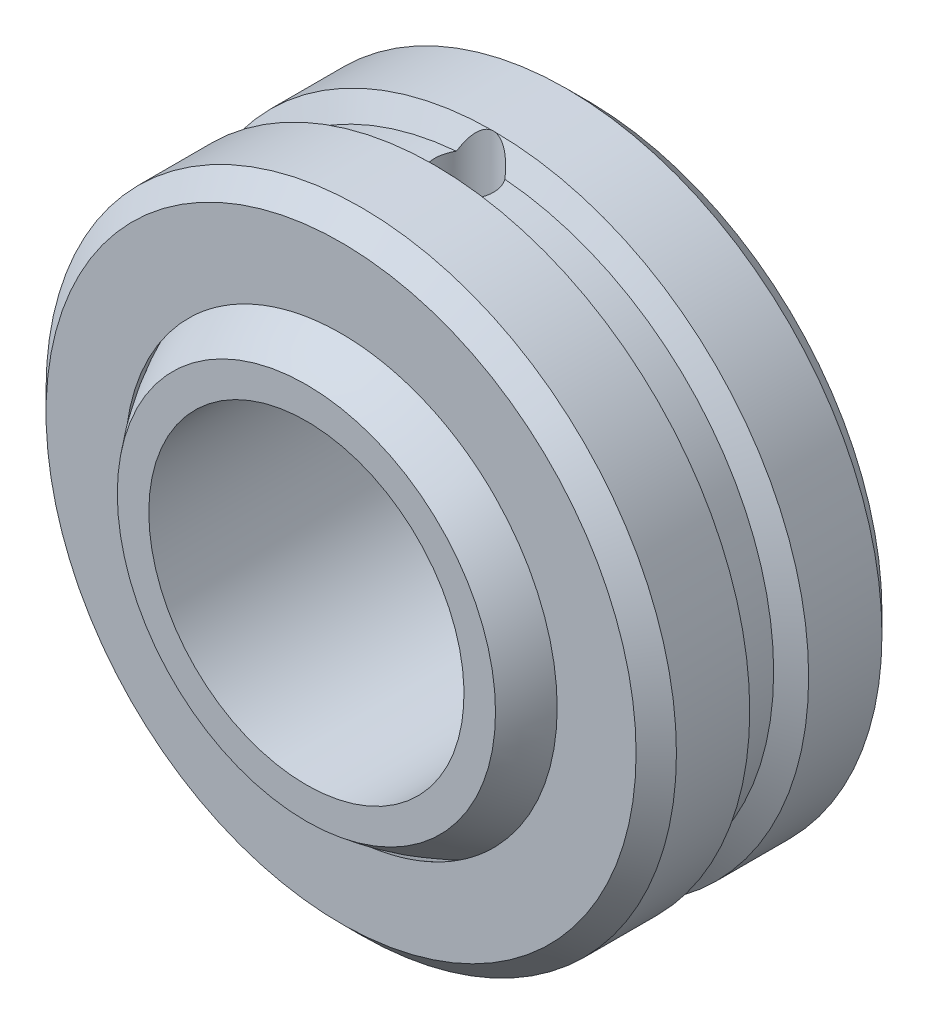
ISO-10303-21;
HEADER;
FILE_DESCRIPTION(('STEP AP214'),'2;1');
FILE_NAME('part.step','',(''),(''),'','','');
FILE_SCHEMA(('AUTOMOTIVE_DESIGN { 1 0 10303 214 1 1 1 1 }'));
ENDSEC;
DATA;
#1=APPLICATION_CONTEXT('core data for automotive mechanical design processes');
#2=APPLICATION_PROTOCOL_DEFINITION('international standard','automotive_design',2000,#1);
#3=PRODUCT_CONTEXT('',#1,'mechanical');
#4=PRODUCT('Part','Part','',(#3));
#5=PRODUCT_RELATED_PRODUCT_CATEGORY('part','',(#4));
#6=PRODUCT_DEFINITION_FORMATION('','',#4);
#7=PRODUCT_DEFINITION_CONTEXT('part definition',#1,'design');
#8=PRODUCT_DEFINITION('design','',#6,#7);
#9=PRODUCT_DEFINITION_SHAPE('','',#8);
#10=(LENGTH_UNIT() NAMED_UNIT(*) SI_UNIT(.MILLI.,.METRE.));
#11=(NAMED_UNIT(*) PLANE_ANGLE_UNIT() SI_UNIT($,.RADIAN.));
#12=(NAMED_UNIT(*) SI_UNIT($,.STERADIAN.) SOLID_ANGLE_UNIT());
#13=UNCERTAINTY_MEASURE_WITH_UNIT(LENGTH_MEASURE(1.E-05),#10,'distance_accuracy_value','');
#14=(GEOMETRIC_REPRESENTATION_CONTEXT(3) GLOBAL_UNCERTAINTY_ASSIGNED_CONTEXT((#13)) GLOBAL_UNIT_ASSIGNED_CONTEXT((#10,
#11,#12)) REPRESENTATION_CONTEXT('',''));
#15=CARTESIAN_POINT('',(0.,0.,0.));
#16=DIRECTION('',(0.,0.,1.));
#17=DIRECTION('',(1.,0.,0.));
#18=AXIS2_PLACEMENT_3D('',#15,#16,#17);
#19=CARTESIAN_POINT('',(0.,0.,0.));
#20=DIRECTION('',(0.,-1.,0.));
#21=DIRECTION('',(-1.,0.,0.));
#22=AXIS2_PLACEMENT_3D('',#19,#20,#21);
#23=SPHERICAL_SURFACE('',#22,9.9187);
#24=CARTESIAN_POINT('',(0.,0.,0.));
#25=DIRECTION('',(0.,0.,1.));
#26=DIRECTION('',(0.,-1.,0.));
#27=AXIS2_PLACEMENT_3D('',#24,#25,#26);
#28=SPHERICAL_SURFACE('',#27,9.9187);
#29=CARTESIAN_POINT('',(0.,0.,-6.35));
#30=DIRECTION('',(0.,0.,1.));
#31=DIRECTION('',(0.,-1.,0.));
#32=AXIS2_PLACEMENT_3D('',#29,#30,#31);
#33=CIRCLE('',#32,7.61958723882075);
#34=CARTESIAN_POINT('',(0.,-7.61958723882075,-6.35));
#35=VERTEX_POINT('',#34);
#36=EDGE_CURVE('E66',#35,#35,#33,.F.);
#37=ORIENTED_EDGE('',*,*,#36,.F.);
#38=EDGE_LOOP('',(#37));
#39=FACE_BOUND('',#38,.T.);
#40=CARTESIAN_POINT('',(0.,0.,6.35));
#41=DIRECTION('',(0.,0.,-1.));
#42=DIRECTION('',(-1.,0.,0.));
#43=AXIS2_PLACEMENT_3D('',#40,#41,#42);
#44=CIRCLE('',#43,7.61958723882075);
#45=CARTESIAN_POINT('',(-7.61958723882075,0.,6.35));
#46=VERTEX_POINT('',#45);
#47=EDGE_CURVE('E11',#46,#46,#44,.F.);
#48=ORIENTED_EDGE('',*,*,#47,.F.);
#49=EDGE_LOOP('',(#48));
#50=FACE_BOUND('',#49,.T.);
#51=ADVANCED_FACE('F52',(#39,#50),#28,.T.);
#52=CARTESIAN_POINT('',(0.,0.,-9.9187));
#53=DIRECTION('',(0.,0.,1.));
#54=DIRECTION('',(1.,0.,0.));
#55=AXIS2_PLACEMENT_3D('',#52,#53,#54);
#56=CYLINDRICAL_SURFACE('',#55,6.35);
#57=CARTESIAN_POINT('',(0.,0.,-6.35));
#58=DIRECTION('',(0.,0.,1.));
#59=DIRECTION('',(0.,-1.,0.));
#60=AXIS2_PLACEMENT_3D('',#57,#58,#59);
#61=CIRCLE('',#60,6.35);
#62=CARTESIAN_POINT('',(0.,-6.35,-6.35));
#63=VERTEX_POINT('',#62);
#64=EDGE_CURVE('E55',#63,#63,#61,.F.);
#65=ORIENTED_EDGE('',*,*,#64,.T.);
#66=EDGE_LOOP('',(#65));
#67=FACE_BOUND('',#66,.T.);
#68=CARTESIAN_POINT('',(0.,0.,6.35));
#69=DIRECTION('',(0.,0.,-1.));
#70=DIRECTION('',(-1.,0.,0.));
#71=AXIS2_PLACEMENT_3D('',#68,#69,#70);
#72=CIRCLE('',#71,6.35);
#73=CARTESIAN_POINT('',(-6.35,0.,6.35));
#74=VERTEX_POINT('',#73);
#75=EDGE_CURVE('E60',#74,#74,#72,.F.);
#76=ORIENTED_EDGE('',*,*,#75,.T.);
#77=EDGE_LOOP('',(#76));
#78=FACE_BOUND('',#77,.T.);
#79=ADVANCED_FACE('F76',(#67,#78),#56,.F.);
#80=CARTESIAN_POINT('',(-12.7,12.7,6.35));
#81=DIRECTION('',(0.,0.,-1.));
#82=DIRECTION('',(-1.,0.,0.));
#83=AXIS2_PLACEMENT_3D('',#80,#81,#82);
#84=PLANE('',#83);
#85=ORIENTED_EDGE('',*,*,#47,.T.);
#86=EDGE_LOOP('',(#85));
#87=FACE_BOUND('',#86,.T.);
#88=ORIENTED_EDGE('',*,*,#75,.F.);
#89=EDGE_LOOP('',(#88));
#90=FACE_BOUND('',#89,.T.);
#91=ADVANCED_FACE('F81',(#87,#90),#84,.F.);
#92=CARTESIAN_POINT('',(-12.7,-12.7,-6.35));
#93=DIRECTION('',(0.,0.,1.));
#94=DIRECTION('',(0.,-1.,0.));
#95=AXIS2_PLACEMENT_3D('',#92,#93,#94);
#96=PLANE('',#95);
#97=ORIENTED_EDGE('',*,*,#36,.T.);
#98=EDGE_LOOP('',(#97));
#99=FACE_BOUND('',#98,.T.);
#100=ORIENTED_EDGE('',*,*,#64,.F.);
#101=EDGE_LOOP('',(#100));
#102=FACE_BOUND('',#101,.T.);
#103=ADVANCED_FACE('F79',(#99,#102),#96,.F.);
#104=CLOSED_SHELL('',(#51,#79,#91,#103));
#105=MANIFOLD_SOLID_BREP('B2',#104);
#106=CARTESIAN_POINT('',(0.,0.,0.));
#107=DIRECTION('',(0.,-1.,0.));
#108=DIRECTION('',(-1.,0.,0.));
#109=AXIS2_PLACEMENT_3D('',#106,#107,#108);
#110=SPHERICAL_SURFACE('',#109,10.017887);
#111=CARTESIAN_POINT('',(0.,0.,4.953));
#112=DIRECTION('',(0.,0.,1.));
#113=DIRECTION('',(1.,0.,0.));
#114=AXIS2_PLACEMENT_3D('',#111,#112,#113);
#115=CIRCLE('',#114,8.7078040253998);
#116=CARTESIAN_POINT('',(8.7078040253998,0.,4.953));
#117=VERTEX_POINT('',#116);
#118=EDGE_CURVE('E198',#117,#117,#115,.T.);
#119=ORIENTED_EDGE('',*,*,#118,.T.);
#120=EDGE_LOOP('',(#119));
#121=FACE_BOUND('',#120,.T.);
#122=CARTESIAN_POINT('',(0.,0.,-4.953));
#123=DIRECTION('',(0.,0.,1.));
#124=DIRECTION('',(1.,0.,0.));
#125=AXIS2_PLACEMENT_3D('',#122,#123,#124);
#126=CIRCLE('',#125,8.7078040253998);
#127=CARTESIAN_POINT('',(8.7078040253998,0.,-4.953));
#128=VERTEX_POINT('',#127);
#129=EDGE_CURVE('E192',#128,#128,#126,.T.);
#130=ORIENTED_EDGE('',*,*,#129,.F.);
#131=EDGE_LOOP('',(#130));
#132=FACE_BOUND('',#131,.T.);
#133=CARTESIAN_POINT('',(0.,9.9473514241223,0.));
#134=DIRECTION('',(0.,-1.,0.));
#135=DIRECTION('',(0.,0.,-1.));
#136=AXIS2_PLACEMENT_3D('',#133,#134,#135);
#137=CIRCLE('',#136,1.18670113751566);
#138=CARTESIAN_POINT('',(0.,9.9473514241223,-1.18670113751566));
#139=VERTEX_POINT('',#138);
#140=EDGE_CURVE('E188',#139,#139,#137,.T.);
#141=ORIENTED_EDGE('',*,*,#140,.F.);
#142=EDGE_LOOP('',(#141));
#143=FACE_BOUND('',#142,.T.);
#144=ADVANCED_FACE('F128',(#121,#132,#143),#110,.F.);
#145=CARTESIAN_POINT('',(0.,0.,1.18670113751566));
#146=DIRECTION('',(0.,0.,1.));
#147=DIRECTION('',(1.,0.,0.));
#148=AXIS2_PLACEMENT_3D('',#145,#146,#147);
#149=CONICAL_SURFACE('',#148,12.7,1.0471975511966);
#150=CARTESIAN_POINT('',(0.,0.,0.670528249999994));
#151=DIRECTION('',(0.,0.,1.));
#152=DIRECTION('',(1.,0.,0.));
#153=AXIS2_PLACEMENT_3D('',#150,#151,#152);
#154=CIRCLE('',#153,11.8059623333333);
#155=CARTESIAN_POINT('',(-0.979107479152773,11.7652919708927,0.670528249999994));
#156=VERTEX_POINT('',#155);
#157=CARTESIAN_POINT('',(0.979107479152773,11.7652919708927,0.670528249999994));
#158=VERTEX_POINT('',#157);
#159=EDGE_CURVE('E186',#156,#158,#154,.T.);
#160=ORIENTED_EDGE('',*,*,#159,.T.);
#161=CARTESIAN_POINT('',(1.01264817987892,11.6723678386189,0.618710961248357));
#162=CARTESIAN_POINT('',(0.994302284342978,11.7260736571961,0.648688345704138));
#163=CARTESIAN_POINT('',(0.974340243953245,11.7794151820802,0.678410816259879));
#164=CARTESIAN_POINT('',(0.930636769835588,11.8851807620967,0.737251959971721));
#165=CARTESIAN_POINT('',(0.906880400512989,11.9376002427684,0.766367710380491));
#166=CARTESIAN_POINT('',(0.854878475422868,12.041498686508,0.823992044670001));
#167=CARTESIAN_POINT('',(0.826583508817466,12.092959392948,0.852489493347161));
#168=CARTESIAN_POINT('',(0.765064087349909,12.1935285234729,0.908105940491037));
#169=CARTESIAN_POINT('',(0.731848612701483,12.2426410215911,0.935227331756228));
#170=CARTESIAN_POINT('',(0.666762925946538,12.3280300115282,0.982324275502115));
#171=CARTESIAN_POINT('',(0.635946789338949,12.3649123293688,1.00264583920002));
#172=CARTESIAN_POINT('',(0.569966545650326,12.4356159106083,1.04156828551371));
#173=CARTESIAN_POINT('',(0.534803746648996,12.4694380896411,1.06016968286293));
#174=CARTESIAN_POINT('',(0.459013200137754,12.5330735405909,1.0951415795159));
#175=CARTESIAN_POINT('',(0.418318380281431,12.5628268505517,1.11147875060371));
#176=CARTESIAN_POINT('',(0.331496816530687,12.6154711756078,1.14036841750999));
#177=CARTESIAN_POINT('',(0.285390337108392,12.6383867207948,1.15293444305531));
#178=CARTESIAN_POINT('',(0.205791560294894,12.6679734799334,1.16915323693821));
#179=CARTESIAN_POINT('',(0.173696093870425,12.6775231877232,1.17438642440313));
#180=CARTESIAN_POINT('',(0.108137751561356,12.6918253383873,1.18222301511865));
#181=CARTESIAN_POINT('',(0.0746761794256924,12.6965822488544,1.184828867434));
#182=CARTESIAN_POINT('',(0.0071927020892218,12.7008394097529,1.18716098409019));
#183=CARTESIAN_POINT('',(-0.0268307647706987,12.7003210343733,1.18687704524826));
#184=CARTESIAN_POINT('',(-0.0942437671988991,12.6940379507262,1.18343502674956));
#185=CARTESIAN_POINT('',(-0.127632976661569,12.6882706144422,1.1802755073653));
#186=CARTESIAN_POINT('',(-0.19167065717905,12.6723479149242,1.17155033759365));
#187=CARTESIAN_POINT('',(-0.222374675161341,12.6623602835661,1.16607665740011));
#188=CARTESIAN_POINT('',(-0.281886218865633,12.6387604555749,1.1531385785858));
#189=CARTESIAN_POINT('',(-0.310693143972236,12.6251471178668,1.14567355325164));
#190=CARTESIAN_POINT('',(-0.385555173411734,12.5845411423169,1.12339769271113));
#191=CARTESIAN_POINT('',(-0.429682195389534,12.5548257413246,1.10708746002312));
#192=CARTESIAN_POINT('',(-0.512270943951605,12.4898464470452,1.07138969512787));
#193=CARTESIAN_POINT('',(-0.550712657484723,12.4545638165673,1.05199176889964));
#194=CARTESIAN_POINT('',(-0.618470384789843,12.3845411645033,1.01345547580416));
#195=CARTESIAN_POINT('',(-0.648326945511408,12.3501939978763,0.9945374942643));
#196=CARTESIAN_POINT('',(-0.704586411528326,12.2793944437988,0.955504507009525));
#197=CARTESIAN_POINT('',(-0.730986352162694,12.2429402873564,0.935388495005252));
#198=CARTESIAN_POINT('',(-0.805739873396817,12.1311532778186,0.87363844404569));
#199=CARTESIAN_POINT('',(-0.849545596036407,12.0535080016648,0.830664047766506));
#200=CARTESIAN_POINT('',(-0.912755445666364,11.9247894201357,0.759253506995267));
#201=CARTESIAN_POINT('',(-0.935130234518487,11.8747440361268,0.731449886033384));
#202=CARTESIAN_POINT('',(-0.976354223786145,11.774037209509,0.675413907998421));
#203=CARTESIAN_POINT('',(-0.995230060804022,11.7233838375017,0.647186722768338));
#204=CARTESIAN_POINT('',(-1.01264817987892,11.6723678386189,0.618710961248357));
#205=B_SPLINE_CURVE_WITH_KNOTS('',3,(#161,#162,#163,#164,#165,#166,#167,#168,#169,#170,#171,
#172,#173,#174,#175,#176,#177,#178,#179,#180,#181,#182,#183,#184,#185,#186,#187,#188,#189,#190,
#191,#192,#193,#194,#195,#196,#197,#198,#199,#200,#201,#202,#203,#204),.UNSPECIFIED.,.F.,.F.,(4,
2,2,2,2,2,2,2,2,2,2,2,2,2,2,2,2,2,2,2,2,4),(0.,0.192585967524381,0.385949591559927,
0.581582422803673,0.776862513866032,0.933176500495647,1.08944356016952,1.24780998555088,
1.40560125445171,1.5068760512066,1.60805635735847,1.709594031303,1.81118257047078,
1.90906554977256,2.00697937108883,2.17294803143943,2.33948768664068,2.48712684417889,
2.63489181022967,2.93090687634187,3.1152325908778,3.29809161819197),.UNSPECIFIED.);
#206=CARTESIAN_POINT('',(0.,12.7,1.18670113751566));
#207=VERTEX_POINT('',#206);
#208=EDGE_CURVE('E160',#158,#207,#205,.T.);
#209=ORIENTED_EDGE('',*,*,#208,.T.);
#210=CARTESIAN_POINT('',(0.,0.,1.18670113751566));
#211=DIRECTION('',(0.,0.,1.));
#212=DIRECTION('',(1.,0.,0.));
#213=AXIS2_PLACEMENT_3D('',#210,#211,#212);
#214=CIRCLE('',#213,12.7);
#215=EDGE_CURVE('E185',#207,#207,#214,.T.);
#216=ORIENTED_EDGE('',*,*,#215,.F.);
#217=EDGE_CURVE('E172',#207,#156,#205,.T.);
#218=ORIENTED_EDGE('',*,*,#217,.T.);
#219=EDGE_LOOP('',(#160,#209,#216,#218));
#220=FACE_BOUND('',#219,.T.);
#221=ADVANCED_FACE('F184',(#220),#149,.T.);
#222=CARTESIAN_POINT('',(0.,0.,0.));
#223=DIRECTION('',(0.,0.,1.));
#224=DIRECTION('',(1.,0.,0.));
#225=AXIS2_PLACEMENT_3D('',#222,#223,#224);
#226=CYLINDRICAL_SURFACE('',#225,11.8059623333333);
#227=CARTESIAN_POINT('',(0.,0.,-0.670528249999994));
#228=DIRECTION('',(0.,0.,1.));
#229=DIRECTION('',(1.,0.,0.));
#230=AXIS2_PLACEMENT_3D('',#227,#228,#229);
#231=CIRCLE('',#230,11.8059623333333);
#232=CARTESIAN_POINT('',(-0.979107479152828,11.7652919708926,-0.670528249999955));
#233=VERTEX_POINT('',#232);
#234=CARTESIAN_POINT('',(0.979107479152773,11.7652919708927,-0.670528249999994));
#235=VERTEX_POINT('',#234);
#236=EDGE_CURVE('E200',#233,#235,#231,.T.);
#237=ORIENTED_EDGE('',*,*,#236,.T.);
#238=CARTESIAN_POINT('',(0.979107479152773,11.7652919708927,-0.670528249999994));
#239=CARTESIAN_POINT('',(0.997914304578762,11.7637265712403,-0.643065891544245));
#240=CARTESIAN_POINT('',(1.01555800980046,11.7622132095906,-0.614823117534829));
#241=CARTESIAN_POINT('',(1.04841464323239,11.7593301784125,-0.556951283364198));
#242=CARTESIAN_POINT('',(1.06362762467246,11.7579605057377,-0.527322253578642));
#243=CARTESIAN_POINT('',(1.10542439426349,11.7541300493828,-0.436703432095171));
#244=CARTESIAN_POINT('',(1.12822115473142,11.7519430577116,-0.373901233310368));
#245=CARTESIAN_POINT('',(1.1629752366505,11.7485549277221,-0.245338189721339));
#246=CARTESIAN_POINT('',(1.17492683572246,11.747354309889,-0.179575802177236));
#247=CARTESIAN_POINT('',(1.18763890494259,11.7460760409731,-0.0469666472243598));
#248=CARTESIAN_POINT('',(1.1884011230921,11.7459982144883,0.0198799491762138));
#249=CARTESIAN_POINT('',(1.17872787776661,11.7469727930861,0.152569068897193));
#250=CARTESIAN_POINT('',(1.16832071742136,11.7480223414145,0.218413703327765));
#251=CARTESIAN_POINT('',(1.13664904270844,11.7511287265675,0.347406736996689));
#252=CARTESIAN_POINT('',(1.11539005855368,11.7531850503061,0.410556491831443));
#253=CARTESIAN_POINT('',(1.07394036996432,11.7570244829051,0.506321653710569));
#254=CARTESIAN_POINT('',(1.05716566420429,11.7585496720442,0.540466636661238));
#255=CARTESIAN_POINT('',(1.02046286164238,11.7617914441645,0.606920862843287));
#256=CARTESIAN_POINT('',(1.000540980848,11.7635076479374,0.639233557575358));
#257=CARTESIAN_POINT('',(0.979107479152773,11.7652919708927,0.670528249999994));
#258=B_SPLINE_CURVE_WITH_KNOTS('',3,(#238,#239,#240,#241,#242,#243,#244,#245,#246,#247,#248,
#249,#250,#251,#252,#253,#254,#255,#256,#257),.UNSPECIFIED.,.F.,.F.,(4,2,2,2,2,2,2,2,2,4),(0.,
0.0999038812143049,0.199805574357514,0.39931916654508,0.598937969677799,0.798525588096007,
0.997608644347179,1.19659034674336,1.31065316803267,1.42449345664376),.UNSPECIFIED.);
#259=EDGE_CURVE('E153',#235,#158,#258,.T.);
#260=ORIENTED_EDGE('',*,*,#259,.T.);
#261=ORIENTED_EDGE('',*,*,#159,.F.);
#262=CARTESIAN_POINT('',(-0.979107479152773,11.7652919708927,0.670528249999994));
#263=CARTESIAN_POINT('',(-0.997914304578762,11.7637265712403,0.643065891544245));
#264=CARTESIAN_POINT('',(-1.01555800980046,11.7622132095906,0.614823117534829));
#265=CARTESIAN_POINT('',(-1.04841464323239,11.7593301784125,0.556951283364198));
#266=CARTESIAN_POINT('',(-1.06362762467246,11.7579605057377,0.527322253578642));
#267=CARTESIAN_POINT('',(-1.10542439426349,11.7541300493828,0.436703432095171));
#268=CARTESIAN_POINT('',(-1.12822115473142,11.7519430577116,0.373901233310368));
#269=CARTESIAN_POINT('',(-1.1629752366505,11.7485549277221,0.245338189721339));
#270=CARTESIAN_POINT('',(-1.17492683572246,11.747354309889,0.179575802177236));
#271=CARTESIAN_POINT('',(-1.18763890494259,11.7460760409731,0.0469666472243598));
#272=CARTESIAN_POINT('',(-1.1884011230921,11.7459982144883,-0.0198799491762138));
#273=CARTESIAN_POINT('',(-1.17872787776661,11.7469727930861,-0.152569068897193));
#274=CARTESIAN_POINT('',(-1.16832071742136,11.7480223414145,-0.218413703327765));
#275=CARTESIAN_POINT('',(-1.13664904270844,11.7511287265675,-0.347406736996689));
#276=CARTESIAN_POINT('',(-1.11539005855368,11.7531850503061,-0.410556491831443));
#277=CARTESIAN_POINT('',(-1.07394036996432,11.7570244829051,-0.506321653710569));
#278=CARTESIAN_POINT('',(-1.05716566420429,11.7585496720442,-0.540466636661238));
#279=CARTESIAN_POINT('',(-1.02046286164238,11.7617914441645,-0.606920862843287));
#280=CARTESIAN_POINT('',(-1.000540980848,11.7635076479374,-0.639233557575358));
#281=CARTESIAN_POINT('',(-0.979107479152773,11.7652919708927,-0.670528249999994));
#282=B_SPLINE_CURVE_WITH_KNOTS('',3,(#262,#263,#264,#265,#266,#267,#268,#269,#270,#271,#272,
#273,#274,#275,#276,#277,#278,#279,#280,#281),.UNSPECIFIED.,.F.,.F.,(4,2,2,2,2,2,2,2,2,4),(0.,
0.0999038812143049,0.199805574357514,0.39931916654508,0.598937969677799,0.798525588096007,
0.997608644347179,1.19659034674336,1.31065316803267,1.42449345664376),.UNSPECIFIED.);
#283=EDGE_CURVE('E176',#156,#233,#282,.T.);
#284=ORIENTED_EDGE('',*,*,#283,.T.);
#285=EDGE_LOOP('',(#237,#260,#261,#284));
#286=FACE_BOUND('',#285,.T.);
#287=ADVANCED_FACE('F232',(#286),#226,.T.);
#288=CARTESIAN_POINT('',(0.,0.,-0.670528249999994));
#289=DIRECTION('',(0.,0.,-1.));
#290=DIRECTION('',(-1.,0.,0.));
#291=AXIS2_PLACEMENT_3D('',#288,#289,#290);
#292=CONICAL_SURFACE('',#291,11.8059623333333,1.0471975511966);
#293=ORIENTED_EDGE('',*,*,#236,.F.);
#294=CARTESIAN_POINT('',(-1.01264817987892,11.6723678386189,-0.618710961248357));
#295=CARTESIAN_POINT('',(-0.994302284342978,11.7260736571961,-0.648688345704138));
#296=CARTESIAN_POINT('',(-0.974340243953245,11.7794151820802,-0.678410816259879));
#297=CARTESIAN_POINT('',(-0.930636769835588,11.8851807620967,-0.737251959971721));
#298=CARTESIAN_POINT('',(-0.906880400512989,11.9376002427684,-0.766367710380491));
#299=CARTESIAN_POINT('',(-0.854878475422868,12.041498686508,-0.823992044670001));
#300=CARTESIAN_POINT('',(-0.826583508817466,12.092959392948,-0.852489493347162));
#301=CARTESIAN_POINT('',(-0.765064087349909,12.1935285234729,-0.908105940491037));
#302=CARTESIAN_POINT('',(-0.731848612701483,12.2426410215911,-0.935227331756228));
#303=CARTESIAN_POINT('',(-0.666762925946538,12.3280300115282,-0.982324275502114));
#304=CARTESIAN_POINT('',(-0.635946789338949,12.3649123293688,-1.00264583920002));
#305=CARTESIAN_POINT('',(-0.569966545650325,12.4356159106083,-1.04156828551371));
#306=CARTESIAN_POINT('',(-0.534803746648995,12.4694380896411,-1.06016968286293));
#307=CARTESIAN_POINT('',(-0.459013200137753,12.5330735405909,-1.0951415795159));
#308=CARTESIAN_POINT('',(-0.41831838028143,12.5628268505517,-1.11147875060371));
#309=CARTESIAN_POINT('',(-0.331496816530684,12.6154711756078,-1.14036841750999));
#310=CARTESIAN_POINT('',(-0.285390337108389,12.6383867207948,-1.15293444305532));
#311=CARTESIAN_POINT('',(-0.205791560294891,12.6679734799334,-1.16915323693821));
#312=CARTESIAN_POINT('',(-0.173696093870422,12.6775231877232,-1.17438642440313));
#313=CARTESIAN_POINT('',(-0.108137751561352,12.6918253383873,-1.18222301511865));
#314=CARTESIAN_POINT('',(-0.0746761794256895,12.6965822488544,-1.184828867434));
#315=CARTESIAN_POINT('',(-0.0071927020892191,12.7008394097529,-1.18716098409019));
#316=CARTESIAN_POINT('',(0.0268307647707013,12.7003210343733,-1.18687704524826));
#317=CARTESIAN_POINT('',(0.0942437671989014,12.6940379507262,-1.18343502674956));
#318=CARTESIAN_POINT('',(0.127632976661571,12.6882706144422,-1.1802755073653));
#319=CARTESIAN_POINT('',(0.191670657179052,12.6723479149242,-1.17155033759365));
#320=CARTESIAN_POINT('',(0.222374675161343,12.6623602835661,-1.16607665740011));
#321=CARTESIAN_POINT('',(0.281886218865634,12.6387604555749,-1.1531385785858));
#322=CARTESIAN_POINT('',(0.310693143972238,12.6251471178668,-1.14567355325164));
#323=CARTESIAN_POINT('',(0.385555173411736,12.5845411423169,-1.12339769271113));
#324=CARTESIAN_POINT('',(0.429682195389536,12.5548257413246,-1.10708746002312));
#325=CARTESIAN_POINT('',(0.512270943951608,12.4898464470452,-1.07138969512787));
#326=CARTESIAN_POINT('',(0.550712657484726,12.4545638165673,-1.05199176889963));
#327=CARTESIAN_POINT('',(0.618470384789846,12.3845411645033,-1.01345547580415));
#328=CARTESIAN_POINT('',(0.648326945511411,12.3501939978763,-0.994537494264298));
#329=CARTESIAN_POINT('',(0.704586411528329,12.2793944437988,-0.955504507009523));
#330=CARTESIAN_POINT('',(0.730986352162698,12.2429402873564,-0.935388495005249));
#331=CARTESIAN_POINT('',(0.805739873396823,12.1311532778186,-0.873638444045685));
#332=CARTESIAN_POINT('',(0.849545596036412,12.0535080016648,-0.830664047766502));
#333=CARTESIAN_POINT('',(0.912755445666367,11.9247894201356,-0.759253506995262));
#334=CARTESIAN_POINT('',(0.935130234518491,11.8747440361268,-0.73144988603338));
#335=CARTESIAN_POINT('',(0.976354223786147,11.774037209509,-0.675413907998419));
#336=CARTESIAN_POINT('',(0.995230060804024,11.7233838375017,-0.647186722768337));
#337=CARTESIAN_POINT('',(1.01264817987892,11.6723678386189,-0.618710961248357));
#338=B_SPLINE_CURVE_WITH_KNOTS('',3,(#294,#295,#296,#297,#298,#299,#300,#301,#302,#303,#304,
#305,#306,#307,#308,#309,#310,#311,#312,#313,#314,#315,#316,#317,#318,#319,#320,#321,#322,#323,
#324,#325,#326,#327,#328,#329,#330,#331,#332,#333,#334,#335,#336,#337),.UNSPECIFIED.,.F.,.F.,(4,
2,2,2,2,2,2,2,2,2,2,2,2,2,2,2,2,2,2,2,2,4),(0.,0.192585967524381,0.385949591559927,
0.581582422803673,0.776862513866032,0.933176500495647,1.08944356016953,1.24780998555088,
1.40560125445171,1.50687605120661,1.60805635735847,1.709594031303,1.81118257047078,
1.90906554977256,2.00697937108884,2.17294803143943,2.33948768664068,2.48712684417889,
2.63489181022968,2.93090687634189,3.11523259087781,3.29809161819197),.UNSPECIFIED.);
#339=CARTESIAN_POINT('',(0.,12.7,-1.18670113751566));
#340=VERTEX_POINT('',#339);
#341=EDGE_CURVE('E50',#233,#340,#338,.T.);
#342=ORIENTED_EDGE('',*,*,#341,.T.);
#343=CARTESIAN_POINT('',(0.,0.,-1.18670113751566));
#344=DIRECTION('',(0.,0.,1.));
#345=DIRECTION('',(1.,0.,0.));
#346=AXIS2_PLACEMENT_3D('',#343,#344,#345);
#347=CIRCLE('',#346,12.7);
#348=EDGE_CURVE('E230',#340,#340,#347,.T.);
#349=ORIENTED_EDGE('',*,*,#348,.T.);
#350=EDGE_CURVE('E132',#340,#235,#338,.T.);
#351=ORIENTED_EDGE('',*,*,#350,.T.);
#352=EDGE_LOOP('',(#293,#342,#349,#351));
#353=FACE_BOUND('',#352,.T.);
#354=ADVANCED_FACE('F228',(#353),#292,.T.);
#355=CARTESIAN_POINT('',(0.,0.,4.953));
#356=DIRECTION('',(0.,0.,-1.));
#357=DIRECTION('',(-1.,0.,0.));
#358=AXIS2_PLACEMENT_3D('',#355,#356,#357);
#359=CYLINDRICAL_SURFACE('',#358,12.7);
#360=CARTESIAN_POINT('',(0.,0.,4.1402));
#361=DIRECTION('',(0.,0.,1.));
#362=DIRECTION('',(1.,0.,0.));
#363=AXIS2_PLACEMENT_3D('',#360,#361,#362);
#364=CIRCLE('',#363,12.7);
#365=CARTESIAN_POINT('',(12.7,0.,4.1402));
#366=VERTEX_POINT('',#365);
#367=EDGE_CURVE('E214',#366,#366,#364,.F.);
#368=ORIENTED_EDGE('',*,*,#367,.T.);
#369=EDGE_LOOP('',(#368));
#370=FACE_BOUND('',#369,.T.);
#371=ORIENTED_EDGE('',*,*,#215,.T.);
#372=EDGE_LOOP('',(#371));
#373=FACE_BOUND('',#372,.T.);
#374=ADVANCED_FACE('F190',(#370,#373),#359,.T.);
#375=CARTESIAN_POINT('',(0.,0.,-4.1402));
#376=DIRECTION('',(0.,0.,1.));
#377=DIRECTION('',(1.,0.,0.));
#378=AXIS2_PLACEMENT_3D('',#375,#376,#377);
#379=CIRCLE('',#378,12.7);
#380=CARTESIAN_POINT('',(12.7,0.,-4.1402));
#381=VERTEX_POINT('',#380);
#382=EDGE_CURVE('E210',#381,#381,#379,.T.);
#383=ORIENTED_EDGE('',*,*,#382,.T.);
#384=EDGE_LOOP('',(#383));
#385=FACE_BOUND('',#384,.T.);
#386=ORIENTED_EDGE('',*,*,#348,.F.);
#387=EDGE_LOOP('',(#386));
#388=FACE_BOUND('',#387,.T.);
#389=ADVANCED_FACE('F281',(#385,#388),#359,.T.);
#390=CARTESIAN_POINT('',(0.,0.,4.953));
#391=DIRECTION('',(0.,0.,1.));
#392=DIRECTION('',(1.,0.,0.));
#393=AXIS2_PLACEMENT_3D('',#390,#391,#392);
#394=PLANE('',#393);
#395=CARTESIAN_POINT('',(0.,0.,4.953));
#396=DIRECTION('',(0.,0.,1.));
#397=DIRECTION('',(1.,0.,0.));
#398=AXIS2_PLACEMENT_3D('',#395,#396,#397);
#399=CIRCLE('',#398,11.8872);
#400=CARTESIAN_POINT('',(11.8872,0.,4.953));
#401=VERTEX_POINT('',#400);
#402=EDGE_CURVE('E205',#401,#401,#399,.T.);
#403=ORIENTED_EDGE('',*,*,#402,.T.);
#404=EDGE_LOOP('',(#403));
#405=FACE_BOUND('',#404,.T.);
#406=ORIENTED_EDGE('',*,*,#118,.F.);
#407=EDGE_LOOP('',(#406));
#408=FACE_BOUND('',#407,.T.);
#409=ADVANCED_FACE('F277',(#405,#408),#394,.T.);
#410=CARTESIAN_POINT('',(0.,0.,-4.953));
#411=DIRECTION('',(0.,0.,1.));
#412=DIRECTION('',(1.,0.,0.));
#413=AXIS2_PLACEMENT_3D('',#410,#411,#412);
#414=PLANE('',#413);
#415=CARTESIAN_POINT('',(0.,0.,-4.953));
#416=DIRECTION('',(0.,0.,1.));
#417=DIRECTION('',(1.,0.,0.));
#418=AXIS2_PLACEMENT_3D('',#415,#416,#417);
#419=CIRCLE('',#418,11.8872);
#420=CARTESIAN_POINT('',(11.8872,0.,-4.953));
#421=VERTEX_POINT('',#420);
#422=EDGE_CURVE('E217',#421,#421,#419,.F.);
#423=ORIENTED_EDGE('',*,*,#422,.T.);
#424=EDGE_LOOP('',(#423));
#425=FACE_BOUND('',#424,.T.);
#426=ORIENTED_EDGE('',*,*,#129,.T.);
#427=EDGE_LOOP('',(#426));
#428=FACE_BOUND('',#427,.T.);
#429=ADVANCED_FACE('F280',(#425,#428),#414,.F.);
#430=CARTESIAN_POINT('',(0.,0.,4.953));
#431=DIRECTION('',(0.,0.,-1.));
#432=DIRECTION('',(-1.,0.,0.));
#433=AXIS2_PLACEMENT_3D('',#430,#431,#432);
#434=CONICAL_SURFACE('',#433,11.8872,0.785398163397447);
#435=ORIENTED_EDGE('',*,*,#367,.F.);
#436=EDGE_LOOP('',(#435));
#437=FACE_BOUND('',#436,.T.);
#438=ORIENTED_EDGE('',*,*,#402,.F.);
#439=EDGE_LOOP('',(#438));
#440=FACE_BOUND('',#439,.T.);
#441=ADVANCED_FACE('F285',(#437,#440),#434,.T.);
#442=CARTESIAN_POINT('',(0.,0.,-4.1402));
#443=DIRECTION('',(0.,0.,1.));
#444=DIRECTION('',(1.,0.,0.));
#445=AXIS2_PLACEMENT_3D('',#442,#443,#444);
#446=CONICAL_SURFACE('',#445,12.7,0.785398163397451);
#447=ORIENTED_EDGE('',*,*,#422,.F.);
#448=EDGE_LOOP('',(#447));
#449=FACE_BOUND('',#448,.T.);
#450=ORIENTED_EDGE('',*,*,#382,.F.);
#451=EDGE_LOOP('',(#450));
#452=FACE_BOUND('',#451,.T.);
#453=ADVANCED_FACE('F130',(#449,#452),#446,.T.);
#454=CARTESIAN_POINT('',(0.,12.7,0.));
#455=DIRECTION('',(0.,-1.,0.));
#456=DIRECTION('',(0.,0.,-1.));
#457=AXIS2_PLACEMENT_3D('',#454,#455,#456);
#458=CYLINDRICAL_SURFACE('',#457,1.18670113751566);
#459=ORIENTED_EDGE('',*,*,#259,.F.);
#460=ORIENTED_EDGE('',*,*,#350,.F.);
#461=ORIENTED_EDGE('',*,*,#341,.F.);
#462=ORIENTED_EDGE('',*,*,#283,.F.);
#463=ORIENTED_EDGE('',*,*,#217,.F.);
#464=ORIENTED_EDGE('',*,*,#208,.F.);
#465=EDGE_LOOP('',(#459,#460,#461,#462,#463,#464));
#466=FACE_BOUND('',#465,.T.);
#467=ORIENTED_EDGE('',*,*,#140,.T.);
#468=EDGE_LOOP('',(#467));
#469=FACE_BOUND('',#468,.T.);
#470=ADVANCED_FACE('F173',(#466,#469),#458,.F.);
#471=CLOSED_SHELL('',(#144,#221,#287,#354,#374,#389,#409,#429,#441,#453,#470));
#472=MANIFOLD_SOLID_BREP('B6',#471);
#473=ADVANCED_BREP_SHAPE_REPRESENTATION('',(#18,#105,#472),#14);
#474=SHAPE_DEFINITION_REPRESENTATION(#9,#473);
ENDSEC;
END-ISO-10303-21;
